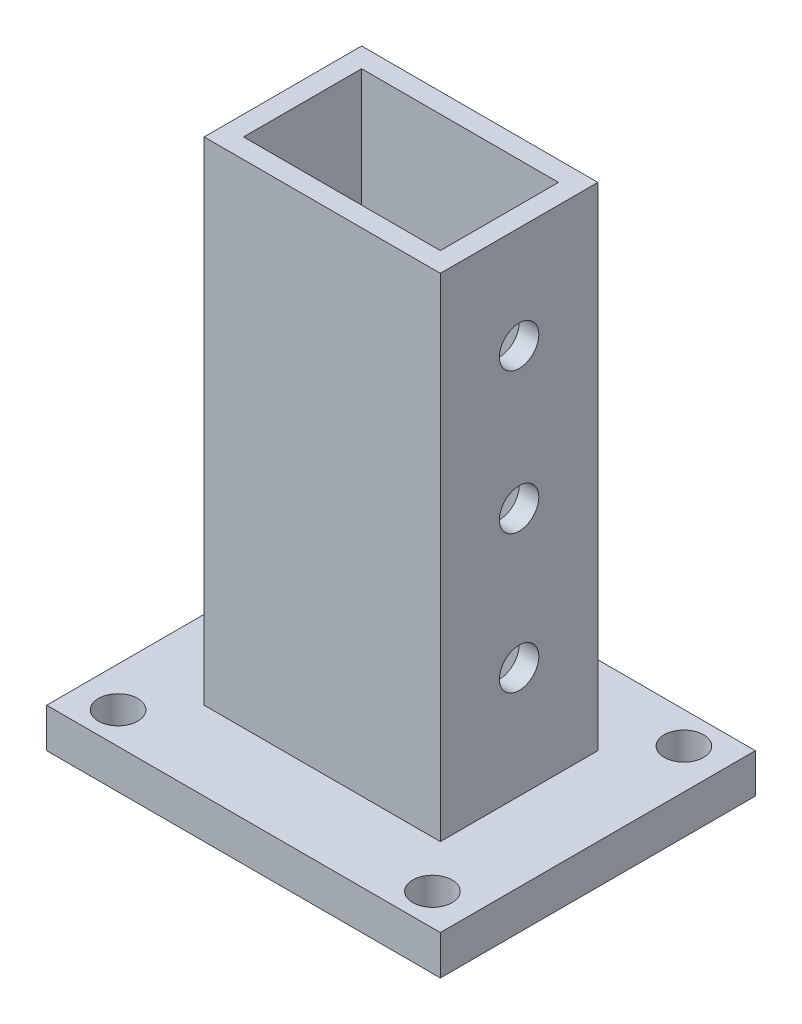
ISO-10303-21;
HEADER;
FILE_DESCRIPTION(('STEP AP214'),'2;1');
FILE_NAME('part.step','',(''),(''),'','','');
FILE_SCHEMA(('AUTOMOTIVE_DESIGN { 1 0 10303 214 1 1 1 1 }'));
ENDSEC;
DATA;
#1=APPLICATION_CONTEXT('core data for automotive mechanical design processes');
#2=APPLICATION_PROTOCOL_DEFINITION('international standard','automotive_design',2000,#1);
#3=PRODUCT_CONTEXT('',#1,'mechanical');
#4=PRODUCT('Part','Part','',(#3));
#5=PRODUCT_RELATED_PRODUCT_CATEGORY('part','',(#4));
#6=PRODUCT_DEFINITION_FORMATION('','',#4);
#7=PRODUCT_DEFINITION_CONTEXT('part definition',#1,'design');
#8=PRODUCT_DEFINITION('design','',#6,#7);
#9=PRODUCT_DEFINITION_SHAPE('','',#8);
#10=(LENGTH_UNIT() NAMED_UNIT(*) SI_UNIT(.MILLI.,.METRE.));
#11=(NAMED_UNIT(*) PLANE_ANGLE_UNIT() SI_UNIT($,.RADIAN.));
#12=(NAMED_UNIT(*) SI_UNIT($,.STERADIAN.) SOLID_ANGLE_UNIT());
#13=UNCERTAINTY_MEASURE_WITH_UNIT(LENGTH_MEASURE(1.E-05),#10,'distance_accuracy_value','');
#14=(GEOMETRIC_REPRESENTATION_CONTEXT(3) GLOBAL_UNCERTAINTY_ASSIGNED_CONTEXT((#13)) GLOBAL_UNIT_ASSIGNED_CONTEXT((#10,
#11,#12)) REPRESENTATION_CONTEXT('',''));
#15=CARTESIAN_POINT('',(0.,0.,0.));
#16=DIRECTION('',(0.,0.,1.));
#17=DIRECTION('',(1.,0.,0.));
#18=AXIS2_PLACEMENT_3D('',#15,#16,#17);
#19=CARTESIAN_POINT('',(0.,10.,0.));
#20=DIRECTION('',(0.,-1.,0.));
#21=DIRECTION('',(0.,0.,-1.));
#22=AXIS2_PLACEMENT_3D('',#19,#20,#21);
#23=PLANE('',#22);
#24=DIRECTION('',(0.,0.,1.));
#25=VECTOR('',#24,1.);
#26=CARTESIAN_POINT('',(-50.,10.,-40.));
#27=LINE('',#26,#25);
#28=CARTESIAN_POINT('',(-50.,10.,-40.));
#29=VERTEX_POINT('',#28);
#30=CARTESIAN_POINT('',(-50.,10.,40.));
#31=VERTEX_POINT('',#30);
#32=EDGE_CURVE('E243',#29,#31,#27,.T.);
#33=ORIENTED_EDGE('',*,*,#32,.T.);
#34=DIRECTION('',(1.,0.,0.));
#35=VECTOR('',#34,1.);
#36=CARTESIAN_POINT('',(50.,10.,40.));
#37=LINE('',#36,#35);
#38=CARTESIAN_POINT('',(50.,10.,40.));
#39=VERTEX_POINT('',#38);
#40=EDGE_CURVE('E246',#31,#39,#37,.T.);
#41=ORIENTED_EDGE('',*,*,#40,.T.);
#42=DIRECTION('',(0.,0.,-1.));
#43=VECTOR('',#42,1.);
#44=CARTESIAN_POINT('',(50.,10.,-40.));
#45=LINE('',#44,#43);
#46=CARTESIAN_POINT('',(50.,10.,-40.));
#47=VERTEX_POINT('',#46);
#48=EDGE_CURVE('E249',#39,#47,#45,.T.);
#49=ORIENTED_EDGE('',*,*,#48,.T.);
#50=DIRECTION('',(-1.,0.,0.));
#51=VECTOR('',#50,1.);
#52=CARTESIAN_POINT('',(50.,10.,-40.));
#53=LINE('',#52,#51);
#54=EDGE_CURVE('E251',#47,#29,#53,.T.);
#55=ORIENTED_EDGE('',*,*,#54,.T.);
#56=EDGE_LOOP('',(#33,#41,#49,#55));
#57=FACE_BOUND('',#56,.T.);
#58=CARTESIAN_POINT('',(-39.9187266223049,10.,-31.9349812978439));
#59=DIRECTION('',(0.,1.,0.));
#60=DIRECTION('',(0.,0.,1.));
#61=AXIS2_PLACEMENT_3D('',#58,#59,#60);
#62=CIRCLE('',#61,5.);
#63=CARTESIAN_POINT('',(-39.9187266223049,10.,-26.9349812978439));
#64=VERTEX_POINT('',#63);
#65=EDGE_CURVE('E237',#64,#64,#62,.T.);
#66=ORIENTED_EDGE('',*,*,#65,.F.);
#67=EDGE_LOOP('',(#66));
#68=FACE_BOUND('',#67,.T.);
#69=CARTESIAN_POINT('',(39.9187266223049,10.,-31.9349812978439));
#70=DIRECTION('',(0.,1.,0.));
#71=DIRECTION('',(0.,0.,1.));
#72=AXIS2_PLACEMENT_3D('',#69,#70,#71);
#73=CIRCLE('',#72,5.);
#74=CARTESIAN_POINT('',(39.9187266223049,10.,-26.9349812978439));
#75=VERTEX_POINT('',#74);
#76=EDGE_CURVE('E231',#75,#75,#73,.T.);
#77=ORIENTED_EDGE('',*,*,#76,.F.);
#78=EDGE_LOOP('',(#77));
#79=FACE_BOUND('',#78,.T.);
#80=CARTESIAN_POINT('',(39.9187266223049,10.,31.9349812978439));
#81=DIRECTION('',(0.,1.,0.));
#82=DIRECTION('',(0.,0.,1.));
#83=AXIS2_PLACEMENT_3D('',#80,#81,#82);
#84=CIRCLE('',#83,5.);
#85=CARTESIAN_POINT('',(39.9187266223049,10.,36.9349812978439));
#86=VERTEX_POINT('',#85);
#87=EDGE_CURVE('E225',#86,#86,#84,.T.);
#88=ORIENTED_EDGE('',*,*,#87,.F.);
#89=EDGE_LOOP('',(#88));
#90=FACE_BOUND('',#89,.T.);
#91=CARTESIAN_POINT('',(-39.918726622305,10.,31.934981297844));
#92=DIRECTION('',(0.,1.,0.));
#93=DIRECTION('',(0.,0.,1.));
#94=AXIS2_PLACEMENT_3D('',#91,#92,#93);
#95=CIRCLE('',#94,5.);
#96=CARTESIAN_POINT('',(-39.918726622305,10.,36.934981297844));
#97=VERTEX_POINT('',#96);
#98=EDGE_CURVE('E219',#97,#97,#95,.T.);
#99=ORIENTED_EDGE('',*,*,#98,.F.);
#100=EDGE_LOOP('',(#99));
#101=FACE_BOUND('',#100,.T.);
#102=DIRECTION('',(0.,0.,-1.));
#103=VECTOR('',#102,1.);
#104=CARTESIAN_POINT('',(30.,10.,0.));
#105=LINE('',#104,#103);
#106=CARTESIAN_POINT('',(30.,10.,20.));
#107=VERTEX_POINT('',#106);
#108=CARTESIAN_POINT('',(30.,10.,-20.));
#109=VERTEX_POINT('',#108);
#110=EDGE_CURVE('E165',#107,#109,#105,.T.);
#111=ORIENTED_EDGE('',*,*,#110,.F.);
#112=DIRECTION('',(1.,0.,0.));
#113=VECTOR('',#112,1.);
#114=CARTESIAN_POINT('',(0.,10.,20.));
#115=LINE('',#114,#113);
#116=CARTESIAN_POINT('',(-30.,10.,20.));
#117=VERTEX_POINT('',#116);
#118=EDGE_CURVE('E195',#117,#107,#115,.T.);
#119=ORIENTED_EDGE('',*,*,#118,.F.);
#120=DIRECTION('',(0.,0.,1.));
#121=VECTOR('',#120,1.);
#122=CARTESIAN_POINT('',(-30.,10.,0.));
#123=LINE('',#122,#121);
#124=CARTESIAN_POINT('',(-30.,10.,-20.));
#125=VERTEX_POINT('',#124);
#126=EDGE_CURVE('E79',#125,#117,#123,.T.);
#127=ORIENTED_EDGE('',*,*,#126,.F.);
#128=DIRECTION('',(-1.,0.,0.));
#129=VECTOR('',#128,1.);
#130=CARTESIAN_POINT('',(0.,10.,-20.));
#131=LINE('',#130,#129);
#132=EDGE_CURVE('E74',#109,#125,#131,.T.);
#133=ORIENTED_EDGE('',*,*,#132,.F.);
#134=EDGE_LOOP('',(#111,#119,#127,#133));
#135=FACE_BOUND('',#134,.T.);
#136=ADVANCED_FACE('F57',(#57,#68,#79,#90,#101,#135),#23,.F.);
#137=CARTESIAN_POINT('',(0.,0.,0.));
#138=DIRECTION('',(0.,-1.,0.));
#139=DIRECTION('',(0.,0.,-1.));
#140=AXIS2_PLACEMENT_3D('',#137,#138,#139);
#141=PLANE('',#140);
#142=CARTESIAN_POINT('',(39.9187266223049,0.,31.9349812978439));
#143=DIRECTION('',(0.,1.,0.));
#144=DIRECTION('',(0.,0.,1.));
#145=AXIS2_PLACEMENT_3D('',#142,#143,#144);
#146=CIRCLE('',#145,5.);
#147=CARTESIAN_POINT('',(39.9187266223049,0.,36.9349812978439));
#148=VERTEX_POINT('',#147);
#149=EDGE_CURVE('E222',#148,#148,#146,.T.);
#150=ORIENTED_EDGE('',*,*,#149,.T.);
#151=EDGE_LOOP('',(#150));
#152=FACE_BOUND('',#151,.T.);
#153=CARTESIAN_POINT('',(-39.9187266223049,0.,-31.9349812978439));
#154=DIRECTION('',(0.,1.,0.));
#155=DIRECTION('',(0.,0.,1.));
#156=AXIS2_PLACEMENT_3D('',#153,#154,#155);
#157=CIRCLE('',#156,5.);
#158=CARTESIAN_POINT('',(-39.9187266223049,0.,-26.9349812978439));
#159=VERTEX_POINT('',#158);
#160=EDGE_CURVE('E234',#159,#159,#157,.T.);
#161=ORIENTED_EDGE('',*,*,#160,.T.);
#162=EDGE_LOOP('',(#161));
#163=FACE_BOUND('',#162,.T.);
#164=DIRECTION('',(0.,0.,1.));
#165=VECTOR('',#164,1.);
#166=CARTESIAN_POINT('',(-50.,0.,-40.));
#167=LINE('',#166,#165);
#168=CARTESIAN_POINT('',(-50.,0.,-40.));
#169=VERTEX_POINT('',#168);
#170=CARTESIAN_POINT('',(-50.,0.,40.));
#171=VERTEX_POINT('',#170);
#172=EDGE_CURVE('E240',#169,#171,#167,.T.);
#173=ORIENTED_EDGE('',*,*,#172,.F.);
#174=DIRECTION('',(-1.,0.,0.));
#175=VECTOR('',#174,1.);
#176=CARTESIAN_POINT('',(50.,0.,-40.));
#177=LINE('',#176,#175);
#178=CARTESIAN_POINT('',(50.,0.,-40.));
#179=VERTEX_POINT('',#178);
#180=EDGE_CURVE('E247',#179,#169,#177,.T.);
#181=ORIENTED_EDGE('',*,*,#180,.F.);
#182=DIRECTION('',(0.,0.,-1.));
#183=VECTOR('',#182,1.);
#184=CARTESIAN_POINT('',(50.,0.,-40.));
#185=LINE('',#184,#183);
#186=CARTESIAN_POINT('',(50.,0.,40.));
#187=VERTEX_POINT('',#186);
#188=EDGE_CURVE('E258',#187,#179,#185,.T.);
#189=ORIENTED_EDGE('',*,*,#188,.F.);
#190=DIRECTION('',(1.,0.,0.));
#191=VECTOR('',#190,1.);
#192=CARTESIAN_POINT('',(50.,0.,40.));
#193=LINE('',#192,#191);
#194=EDGE_CURVE('E256',#171,#187,#193,.T.);
#195=ORIENTED_EDGE('',*,*,#194,.F.);
#196=EDGE_LOOP('',(#173,#181,#189,#195));
#197=FACE_BOUND('',#196,.T.);
#198=CARTESIAN_POINT('',(39.9187266223049,0.,-31.9349812978439));
#199=DIRECTION('',(0.,1.,0.));
#200=DIRECTION('',(0.,0.,1.));
#201=AXIS2_PLACEMENT_3D('',#198,#199,#200);
#202=CIRCLE('',#201,5.);
#203=CARTESIAN_POINT('',(39.9187266223049,0.,-26.9349812978439));
#204=VERTEX_POINT('',#203);
#205=EDGE_CURVE('E228',#204,#204,#202,.T.);
#206=ORIENTED_EDGE('',*,*,#205,.T.);
#207=EDGE_LOOP('',(#206));
#208=FACE_BOUND('',#207,.T.);
#209=CARTESIAN_POINT('',(-39.918726622305,0.,31.934981297844));
#210=DIRECTION('',(0.,1.,0.));
#211=DIRECTION('',(0.,0.,1.));
#212=AXIS2_PLACEMENT_3D('',#209,#210,#211);
#213=CIRCLE('',#212,5.);
#214=CARTESIAN_POINT('',(-39.918726622305,0.,36.934981297844));
#215=VERTEX_POINT('',#214);
#216=EDGE_CURVE('E218',#215,#215,#213,.T.);
#217=ORIENTED_EDGE('',*,*,#216,.T.);
#218=EDGE_LOOP('',(#217));
#219=FACE_BOUND('',#218,.T.);
#220=ADVANCED_FACE('F315',(#152,#163,#197,#208,#219),#141,.T.);
#221=CARTESIAN_POINT('',(-50.,10.,-40.));
#222=DIRECTION('',(1.,0.,0.));
#223=DIRECTION('',(0.,0.,-1.));
#224=AXIS2_PLACEMENT_3D('',#221,#222,#223);
#225=PLANE('',#224);
#226=ORIENTED_EDGE('',*,*,#172,.T.);
#227=DIRECTION('',(0.,-1.,0.));
#228=VECTOR('',#227,1.);
#229=CARTESIAN_POINT('',(-50.,10.,40.));
#230=LINE('',#229,#228);
#231=EDGE_CURVE('E12',#31,#171,#230,.T.);
#232=ORIENTED_EDGE('',*,*,#231,.F.);
#233=ORIENTED_EDGE('',*,*,#32,.F.);
#234=DIRECTION('',(0.,-1.,0.));
#235=VECTOR('',#234,1.);
#236=CARTESIAN_POINT('',(-50.,10.,-40.));
#237=LINE('',#236,#235);
#238=EDGE_CURVE('E253',#29,#169,#237,.T.);
#239=ORIENTED_EDGE('',*,*,#238,.T.);
#240=EDGE_LOOP('',(#226,#232,#233,#239));
#241=FACE_BOUND('',#240,.T.);
#242=ADVANCED_FACE('F59',(#241),#225,.F.);
#243=CARTESIAN_POINT('',(50.,10.,40.));
#244=DIRECTION('',(0.,0.,-1.));
#245=DIRECTION('',(-1.,0.,0.));
#246=AXIS2_PLACEMENT_3D('',#243,#244,#245);
#247=PLANE('',#246);
#248=ORIENTED_EDGE('',*,*,#194,.T.);
#249=DIRECTION('',(0.,-1.,0.));
#250=VECTOR('',#249,1.);
#251=CARTESIAN_POINT('',(50.,10.,40.));
#252=LINE('',#251,#250);
#253=EDGE_CURVE('E66',#39,#187,#252,.T.);
#254=ORIENTED_EDGE('',*,*,#253,.F.);
#255=ORIENTED_EDGE('',*,*,#40,.F.);
#256=ORIENTED_EDGE('',*,*,#231,.T.);
#257=EDGE_LOOP('',(#248,#254,#255,#256));
#258=FACE_BOUND('',#257,.T.);
#259=ADVANCED_FACE('F417',(#258),#247,.F.);
#260=CARTESIAN_POINT('',(50.,10.,-40.));
#261=DIRECTION('',(-1.,0.,0.));
#262=DIRECTION('',(0.,0.,1.));
#263=AXIS2_PLACEMENT_3D('',#260,#261,#262);
#264=PLANE('',#263);
#265=ORIENTED_EDGE('',*,*,#188,.T.);
#266=DIRECTION('',(0.,-1.,0.));
#267=VECTOR('',#266,1.);
#268=CARTESIAN_POINT('',(50.,10.,-40.));
#269=LINE('',#268,#267);
#270=EDGE_CURVE('E263',#47,#179,#269,.T.);
#271=ORIENTED_EDGE('',*,*,#270,.F.);
#272=ORIENTED_EDGE('',*,*,#48,.F.);
#273=ORIENTED_EDGE('',*,*,#253,.T.);
#274=EDGE_LOOP('',(#265,#271,#272,#273));
#275=FACE_BOUND('',#274,.T.);
#276=ADVANCED_FACE('F390',(#275),#264,.F.);
#277=CARTESIAN_POINT('',(50.,10.,-40.));
#278=DIRECTION('',(0.,0.,1.));
#279=DIRECTION('',(1.,0.,0.));
#280=AXIS2_PLACEMENT_3D('',#277,#278,#279);
#281=PLANE('',#280);
#282=ORIENTED_EDGE('',*,*,#180,.T.);
#283=ORIENTED_EDGE('',*,*,#238,.F.);
#284=ORIENTED_EDGE('',*,*,#54,.F.);
#285=ORIENTED_EDGE('',*,*,#270,.T.);
#286=EDGE_LOOP('',(#282,#283,#284,#285));
#287=FACE_BOUND('',#286,.T.);
#288=ADVANCED_FACE('F385',(#287),#281,.F.);
#289=CARTESIAN_POINT('',(-39.9187266223049,10.,-31.9349812978439));
#290=DIRECTION('',(0.,-1.,0.));
#291=DIRECTION('',(0.,0.,-1.));
#292=AXIS2_PLACEMENT_3D('',#289,#290,#291);
#293=CYLINDRICAL_SURFACE('',#292,5.);
#294=ORIENTED_EDGE('',*,*,#65,.T.);
#295=EDGE_LOOP('',(#294));
#296=FACE_BOUND('',#295,.T.);
#297=ORIENTED_EDGE('',*,*,#160,.F.);
#298=EDGE_LOOP('',(#297));
#299=FACE_BOUND('',#298,.T.);
#300=ADVANCED_FACE('F382',(#296,#299),#293,.F.);
#301=CARTESIAN_POINT('',(39.9187266223049,10.,-31.9349812978439));
#302=DIRECTION('',(0.,-1.,0.));
#303=DIRECTION('',(0.,0.,-1.));
#304=AXIS2_PLACEMENT_3D('',#301,#302,#303);
#305=CYLINDRICAL_SURFACE('',#304,5.);
#306=ORIENTED_EDGE('',*,*,#76,.T.);
#307=EDGE_LOOP('',(#306));
#308=FACE_BOUND('',#307,.T.);
#309=ORIENTED_EDGE('',*,*,#205,.F.);
#310=EDGE_LOOP('',(#309));
#311=FACE_BOUND('',#310,.T.);
#312=ADVANCED_FACE('F379',(#308,#311),#305,.F.);
#313=CARTESIAN_POINT('',(39.9187266223049,10.,31.9349812978439));
#314=DIRECTION('',(0.,-1.,0.));
#315=DIRECTION('',(0.,0.,-1.));
#316=AXIS2_PLACEMENT_3D('',#313,#314,#315);
#317=CYLINDRICAL_SURFACE('',#316,5.);
#318=ORIENTED_EDGE('',*,*,#87,.T.);
#319=EDGE_LOOP('',(#318));
#320=FACE_BOUND('',#319,.T.);
#321=ORIENTED_EDGE('',*,*,#149,.F.);
#322=EDGE_LOOP('',(#321));
#323=FACE_BOUND('',#322,.T.);
#324=ADVANCED_FACE('F375',(#320,#323),#317,.F.);
#325=CARTESIAN_POINT('',(-39.918726622305,10.,31.934981297844));
#326=DIRECTION('',(0.,-1.,0.));
#327=DIRECTION('',(0.,0.,-1.));
#328=AXIS2_PLACEMENT_3D('',#325,#326,#327);
#329=CYLINDRICAL_SURFACE('',#328,5.);
#330=ORIENTED_EDGE('',*,*,#98,.T.);
#331=EDGE_LOOP('',(#330));
#332=FACE_BOUND('',#331,.T.);
#333=ORIENTED_EDGE('',*,*,#216,.F.);
#334=EDGE_LOOP('',(#333));
#335=FACE_BOUND('',#334,.T.);
#336=ADVANCED_FACE('F358',(#332,#335),#329,.F.);
#337=CARTESIAN_POINT('',(0.,135.,0.));
#338=DIRECTION('',(0.,1.,0.));
#339=DIRECTION('',(0.,0.,1.));
#340=AXIS2_PLACEMENT_3D('',#337,#338,#339);
#341=PLANE('',#340);
#342=DIRECTION('',(0.,0.,-1.));
#343=VECTOR('',#342,1.);
#344=CARTESIAN_POINT('',(30.,135.,0.));
#345=LINE('',#344,#343);
#346=CARTESIAN_POINT('',(30.,135.,20.));
#347=VERTEX_POINT('',#346);
#348=CARTESIAN_POINT('',(30.,135.,-20.));
#349=VERTEX_POINT('',#348);
#350=EDGE_CURVE('E191',#347,#349,#345,.T.);
#351=ORIENTED_EDGE('',*,*,#350,.T.);
#352=DIRECTION('',(-1.,0.,0.));
#353=VECTOR('',#352,1.);
#354=CARTESIAN_POINT('',(0.,135.,-20.));
#355=LINE('',#354,#353);
#356=CARTESIAN_POINT('',(-30.,135.,-20.));
#357=VERTEX_POINT('',#356);
#358=EDGE_CURVE('E194',#349,#357,#355,.T.);
#359=ORIENTED_EDGE('',*,*,#358,.T.);
#360=DIRECTION('',(0.,0.,1.));
#361=VECTOR('',#360,1.);
#362=CARTESIAN_POINT('',(-30.,135.,0.));
#363=LINE('',#362,#361);
#364=CARTESIAN_POINT('',(-30.,135.,20.));
#365=VERTEX_POINT('',#364);
#366=EDGE_CURVE('E197',#357,#365,#363,.T.);
#367=ORIENTED_EDGE('',*,*,#366,.T.);
#368=DIRECTION('',(1.,0.,0.));
#369=VECTOR('',#368,1.);
#370=CARTESIAN_POINT('',(0.,135.,20.));
#371=LINE('',#370,#369);
#372=EDGE_CURVE('E199',#365,#347,#371,.T.);
#373=ORIENTED_EDGE('',*,*,#372,.T.);
#374=EDGE_LOOP('',(#351,#359,#367,#373));
#375=FACE_BOUND('',#374,.T.);
#376=DIRECTION('',(-1.,0.,0.));
#377=VECTOR('',#376,1.);
#378=CARTESIAN_POINT('',(-25.,135.,-15.));
#379=LINE('',#378,#377);
#380=CARTESIAN_POINT('',(25.,135.,-15.));
#381=VERTEX_POINT('',#380);
#382=CARTESIAN_POINT('',(-25.,135.,-15.));
#383=VERTEX_POINT('',#382);
#384=EDGE_CURVE('E157',#381,#383,#379,.T.);
#385=ORIENTED_EDGE('',*,*,#384,.F.);
#386=DIRECTION('',(0.,0.,-1.));
#387=VECTOR('',#386,1.);
#388=CARTESIAN_POINT('',(25.,135.,15.));
#389=LINE('',#388,#387);
#390=CARTESIAN_POINT('',(25.,135.,15.));
#391=VERTEX_POINT('',#390);
#392=EDGE_CURVE('E147',#391,#381,#389,.T.);
#393=ORIENTED_EDGE('',*,*,#392,.F.);
#394=DIRECTION('',(1.,0.,0.));
#395=VECTOR('',#394,1.);
#396=CARTESIAN_POINT('',(-25.,135.,15.));
#397=LINE('',#396,#395);
#398=CARTESIAN_POINT('',(-25.,135.,15.));
#399=VERTEX_POINT('',#398);
#400=EDGE_CURVE('E173',#399,#391,#397,.T.);
#401=ORIENTED_EDGE('',*,*,#400,.F.);
#402=DIRECTION('',(0.,0.,1.));
#403=VECTOR('',#402,1.);
#404=CARTESIAN_POINT('',(-25.,135.,15.));
#405=LINE('',#404,#403);
#406=EDGE_CURVE('E171',#383,#399,#405,.T.);
#407=ORIENTED_EDGE('',*,*,#406,.F.);
#408=EDGE_LOOP('',(#385,#393,#401,#407));
#409=FACE_BOUND('',#408,.T.);
#410=ADVANCED_FACE('F169',(#375,#409),#341,.T.);
#411=CARTESIAN_POINT('',(30.,135.,0.));
#412=DIRECTION('',(-1.,0.,0.));
#413=DIRECTION('',(0.,0.,1.));
#414=AXIS2_PLACEMENT_3D('',#411,#412,#413);
#415=PLANE('',#414);
#416=CARTESIAN_POINT('',(30.,38.2290885239722,0.));
#417=DIRECTION('',(-1.,0.,0.));
#418=DIRECTION('',(0.,0.,1.));
#419=AXIS2_PLACEMENT_3D('',#416,#417,#418);
#420=CIRCLE('',#419,5.);
#421=CARTESIAN_POINT('',(30.,38.2290885239722,5.));
#422=VERTEX_POINT('',#421);
#423=EDGE_CURVE('E180',#422,#422,#420,.T.);
#424=ORIENTED_EDGE('',*,*,#423,.T.);
#425=EDGE_LOOP('',(#424));
#426=FACE_BOUND('',#425,.T.);
#427=CARTESIAN_POINT('',(30.,73.2807756206577,0.));
#428=DIRECTION('',(-1.,0.,0.));
#429=DIRECTION('',(0.,0.,1.));
#430=AXIS2_PLACEMENT_3D('',#427,#428,#429);
#431=CIRCLE('',#430,5.);
#432=CARTESIAN_POINT('',(30.,73.2807756206577,5.));
#433=VERTEX_POINT('',#432);
#434=EDGE_CURVE('E279',#433,#433,#431,.T.);
#435=ORIENTED_EDGE('',*,*,#434,.T.);
#436=EDGE_LOOP('',(#435));
#437=FACE_BOUND('',#436,.T.);
#438=CARTESIAN_POINT('',(30.,109.066529462824,0.));
#439=DIRECTION('',(-1.,0.,0.));
#440=DIRECTION('',(0.,0.,1.));
#441=AXIS2_PLACEMENT_3D('',#438,#439,#440);
#442=CIRCLE('',#441,5.);
#443=CARTESIAN_POINT('',(30.,109.066529462824,5.));
#444=VERTEX_POINT('',#443);
#445=EDGE_CURVE('E275',#444,#444,#442,.T.);
#446=ORIENTED_EDGE('',*,*,#445,.T.);
#447=EDGE_LOOP('',(#446));
#448=FACE_BOUND('',#447,.T.);
#449=ORIENTED_EDGE('',*,*,#110,.T.);
#450=DIRECTION('',(0.,-1.,0.));
#451=VECTOR('',#450,1.);
#452=CARTESIAN_POINT('',(30.,135.,-20.));
#453=LINE('',#452,#451);
#454=EDGE_CURVE('E216',#349,#109,#453,.T.);
#455=ORIENTED_EDGE('',*,*,#454,.F.);
#456=ORIENTED_EDGE('',*,*,#350,.F.);
#457=DIRECTION('',(0.,-1.,0.));
#458=VECTOR('',#457,1.);
#459=CARTESIAN_POINT('',(30.,135.,20.));
#460=LINE('',#459,#458);
#461=EDGE_CURVE('E201',#347,#107,#460,.T.);
#462=ORIENTED_EDGE('',*,*,#461,.T.);
#463=EDGE_LOOP('',(#449,#455,#456,#462));
#464=FACE_BOUND('',#463,.T.);
#465=ADVANCED_FACE('F296',(#426,#437,#448,#464),#415,.F.);
#466=CARTESIAN_POINT('',(0.,135.,-20.));
#467=DIRECTION('',(0.,0.,1.));
#468=DIRECTION('',(1.,0.,0.));
#469=AXIS2_PLACEMENT_3D('',#466,#467,#468);
#470=PLANE('',#469);
#471=ORIENTED_EDGE('',*,*,#132,.T.);
#472=DIRECTION('',(0.,-1.,0.));
#473=VECTOR('',#472,1.);
#474=CARTESIAN_POINT('',(-30.,135.,-20.));
#475=LINE('',#474,#473);
#476=EDGE_CURVE('E213',#357,#125,#475,.T.);
#477=ORIENTED_EDGE('',*,*,#476,.F.);
#478=ORIENTED_EDGE('',*,*,#358,.F.);
#479=ORIENTED_EDGE('',*,*,#454,.T.);
#480=EDGE_LOOP('',(#471,#477,#478,#479));
#481=FACE_BOUND('',#480,.T.);
#482=ADVANCED_FACE('F366',(#481),#470,.F.);
#483=CARTESIAN_POINT('',(-30.,135.,0.));
#484=DIRECTION('',(1.,0.,0.));
#485=DIRECTION('',(0.,0.,-1.));
#486=AXIS2_PLACEMENT_3D('',#483,#484,#485);
#487=PLANE('',#486);
#488=CARTESIAN_POINT('',(-30.,38.2290885239722,0.));
#489=DIRECTION('',(-1.,0.,0.));
#490=DIRECTION('',(0.,0.,1.));
#491=AXIS2_PLACEMENT_3D('',#488,#489,#490);
#492=CIRCLE('',#491,5.);
#493=CARTESIAN_POINT('',(-30.,38.2290885239722,5.));
#494=VERTEX_POINT('',#493);
#495=EDGE_CURVE('E271',#494,#494,#492,.T.);
#496=ORIENTED_EDGE('',*,*,#495,.F.);
#497=EDGE_LOOP('',(#496));
#498=FACE_BOUND('',#497,.T.);
#499=CARTESIAN_POINT('',(-30.,73.2807756206577,0.));
#500=DIRECTION('',(-1.,0.,0.));
#501=DIRECTION('',(0.,0.,1.));
#502=AXIS2_PLACEMENT_3D('',#499,#500,#501);
#503=CIRCLE('',#502,5.);
#504=CARTESIAN_POINT('',(-30.,73.2807756206577,5.));
#505=VERTEX_POINT('',#504);
#506=EDGE_CURVE('E563',#505,#505,#503,.T.);
#507=ORIENTED_EDGE('',*,*,#506,.F.);
#508=EDGE_LOOP('',(#507));
#509=FACE_BOUND('',#508,.T.);
#510=CARTESIAN_POINT('',(-30.,109.066529462824,0.));
#511=DIRECTION('',(-1.,0.,0.));
#512=DIRECTION('',(0.,0.,1.));
#513=AXIS2_PLACEMENT_3D('',#510,#511,#512);
#514=CIRCLE('',#513,5.);
#515=CARTESIAN_POINT('',(-30.,109.066529462824,5.));
#516=VERTEX_POINT('',#515);
#517=EDGE_CURVE('E565',#516,#516,#514,.T.);
#518=ORIENTED_EDGE('',*,*,#517,.F.);
#519=EDGE_LOOP('',(#518));
#520=FACE_BOUND('',#519,.T.);
#521=ORIENTED_EDGE('',*,*,#126,.T.);
#522=DIRECTION('',(0.,-1.,0.));
#523=VECTOR('',#522,1.);
#524=CARTESIAN_POINT('',(-30.,135.,20.));
#525=LINE('',#524,#523);
#526=EDGE_CURVE('E210',#365,#117,#525,.T.);
#527=ORIENTED_EDGE('',*,*,#526,.F.);
#528=ORIENTED_EDGE('',*,*,#366,.F.);
#529=ORIENTED_EDGE('',*,*,#476,.T.);
#530=EDGE_LOOP('',(#521,#527,#528,#529));
#531=FACE_BOUND('',#530,.T.);
#532=ADVANCED_FACE('F362',(#498,#509,#520,#531),#487,.F.);
#533=CARTESIAN_POINT('',(0.,135.,20.));
#534=DIRECTION('',(0.,0.,-1.));
#535=DIRECTION('',(-1.,0.,0.));
#536=AXIS2_PLACEMENT_3D('',#533,#534,#535);
#537=PLANE('',#536);
#538=ORIENTED_EDGE('',*,*,#118,.T.);
#539=ORIENTED_EDGE('',*,*,#461,.F.);
#540=ORIENTED_EDGE('',*,*,#372,.F.);
#541=ORIENTED_EDGE('',*,*,#526,.T.);
#542=EDGE_LOOP('',(#538,#539,#540,#541));
#543=FACE_BOUND('',#542,.T.);
#544=ADVANCED_FACE('F354',(#543),#537,.F.);
#545=CARTESIAN_POINT('',(25.,135.,15.));
#546=DIRECTION('',(-1.,0.,0.));
#547=DIRECTION('',(0.,0.,1.));
#548=AXIS2_PLACEMENT_3D('',#545,#546,#547);
#549=PLANE('',#548);
#550=CARTESIAN_POINT('',(25.,38.2290885239722,0.));
#551=DIRECTION('',(-1.,0.,0.));
#552=DIRECTION('',(0.,0.,1.));
#553=AXIS2_PLACEMENT_3D('',#550,#551,#552);
#554=CIRCLE('',#553,5.);
#555=CARTESIAN_POINT('',(25.,38.2290885239722,5.));
#556=VERTEX_POINT('',#555);
#557=EDGE_CURVE('E291',#556,#556,#554,.T.);
#558=ORIENTED_EDGE('',*,*,#557,.F.);
#559=EDGE_LOOP('',(#558));
#560=FACE_BOUND('',#559,.T.);
#561=CARTESIAN_POINT('',(25.,73.2807756206577,0.));
#562=DIRECTION('',(-1.,0.,0.));
#563=DIRECTION('',(0.,0.,1.));
#564=AXIS2_PLACEMENT_3D('',#561,#562,#563);
#565=CIRCLE('',#564,5.);
#566=CARTESIAN_POINT('',(25.,73.2807756206577,5.));
#567=VERTEX_POINT('',#566);
#568=EDGE_CURVE('E274',#567,#567,#565,.T.);
#569=ORIENTED_EDGE('',*,*,#568,.F.);
#570=EDGE_LOOP('',(#569));
#571=FACE_BOUND('',#570,.T.);
#572=CARTESIAN_POINT('',(25.,109.066529462824,0.));
#573=DIRECTION('',(-1.,0.,0.));
#574=DIRECTION('',(0.,0.,1.));
#575=AXIS2_PLACEMENT_3D('',#572,#573,#574);
#576=CIRCLE('',#575,5.);
#577=CARTESIAN_POINT('',(25.,109.066529462824,5.));
#578=VERTEX_POINT('',#577);
#579=EDGE_CURVE('E270',#578,#578,#576,.T.);
#580=ORIENTED_EDGE('',*,*,#579,.F.);
#581=EDGE_LOOP('',(#580));
#582=FACE_BOUND('',#581,.T.);
#583=DIRECTION('',(0.,0.,-1.));
#584=VECTOR('',#583,1.);
#585=CARTESIAN_POINT('',(25.,10.,15.));
#586=LINE('',#585,#584);
#587=CARTESIAN_POINT('',(25.,10.,15.));
#588=VERTEX_POINT('',#587);
#589=CARTESIAN_POINT('',(25.,10.,-15.));
#590=VERTEX_POINT('',#589);
#591=EDGE_CURVE('E178',#588,#590,#586,.T.);
#592=ORIENTED_EDGE('',*,*,#591,.F.);
#593=DIRECTION('',(0.,-1.,0.));
#594=VECTOR('',#593,1.);
#595=CARTESIAN_POINT('',(25.,135.,15.));
#596=LINE('',#595,#594);
#597=EDGE_CURVE('E153',#391,#588,#596,.T.);
#598=ORIENTED_EDGE('',*,*,#597,.F.);
#599=ORIENTED_EDGE('',*,*,#392,.T.);
#600=DIRECTION('',(0.,-1.,0.));
#601=VECTOR('',#600,1.);
#602=CARTESIAN_POINT('',(25.,135.,-15.));
#603=LINE('',#602,#601);
#604=EDGE_CURVE('E151',#381,#590,#603,.T.);
#605=ORIENTED_EDGE('',*,*,#604,.T.);
#606=EDGE_LOOP('',(#592,#598,#599,#605));
#607=FACE_BOUND('',#606,.T.);
#608=ADVANCED_FACE('F150',(#560,#571,#582,#607),#549,.T.);
#609=CARTESIAN_POINT('',(-25.,135.,-15.));
#610=DIRECTION('',(0.,0.,1.));
#611=DIRECTION('',(1.,0.,0.));
#612=AXIS2_PLACEMENT_3D('',#609,#610,#611);
#613=PLANE('',#612);
#614=DIRECTION('',(-1.,0.,0.));
#615=VECTOR('',#614,1.);
#616=CARTESIAN_POINT('',(-25.,10.,-15.));
#617=LINE('',#616,#615);
#618=CARTESIAN_POINT('',(-25.,10.,-15.));
#619=VERTEX_POINT('',#618);
#620=EDGE_CURVE('E164',#590,#619,#617,.T.);
#621=ORIENTED_EDGE('',*,*,#620,.F.);
#622=ORIENTED_EDGE('',*,*,#604,.F.);
#623=ORIENTED_EDGE('',*,*,#384,.T.);
#624=DIRECTION('',(0.,-1.,0.));
#625=VECTOR('',#624,1.);
#626=CARTESIAN_POINT('',(-25.,135.,-15.));
#627=LINE('',#626,#625);
#628=EDGE_CURVE('E166',#383,#619,#627,.T.);
#629=ORIENTED_EDGE('',*,*,#628,.T.);
#630=EDGE_LOOP('',(#621,#622,#623,#629));
#631=FACE_BOUND('',#630,.T.);
#632=ADVANCED_FACE('F161',(#631),#613,.T.);
#633=CARTESIAN_POINT('',(-25.,135.,15.));
#634=DIRECTION('',(1.,0.,0.));
#635=DIRECTION('',(0.,0.,-1.));
#636=AXIS2_PLACEMENT_3D('',#633,#634,#635);
#637=PLANE('',#636);
#638=CARTESIAN_POINT('',(-25.,38.2290885239722,0.));
#639=DIRECTION('',(1.,0.,0.));
#640=DIRECTION('',(0.,0.,-1.));
#641=AXIS2_PLACEMENT_3D('',#638,#639,#640);
#642=CIRCLE('',#641,5.);
#643=CARTESIAN_POINT('',(-25.,38.2290885239722,-5.));
#644=VERTEX_POINT('',#643);
#645=EDGE_CURVE('E61',#644,#644,#642,.T.);
#646=ORIENTED_EDGE('',*,*,#645,.F.);
#647=EDGE_LOOP('',(#646));
#648=FACE_BOUND('',#647,.T.);
#649=CARTESIAN_POINT('',(-25.,73.2807756206577,0.));
#650=DIRECTION('',(1.,0.,0.));
#651=DIRECTION('',(0.,0.,-1.));
#652=AXIS2_PLACEMENT_3D('',#649,#650,#651);
#653=CIRCLE('',#652,5.);
#654=CARTESIAN_POINT('',(-25.,73.2807756206577,-5.));
#655=VERTEX_POINT('',#654);
#656=EDGE_CURVE('E272',#655,#655,#653,.T.);
#657=ORIENTED_EDGE('',*,*,#656,.F.);
#658=EDGE_LOOP('',(#657));
#659=FACE_BOUND('',#658,.T.);
#660=CARTESIAN_POINT('',(-25.,109.066529462824,0.));
#661=DIRECTION('',(1.,0.,0.));
#662=DIRECTION('',(0.,0.,-1.));
#663=AXIS2_PLACEMENT_3D('',#660,#661,#662);
#664=CIRCLE('',#663,5.);
#665=CARTESIAN_POINT('',(-25.,109.066529462824,-5.));
#666=VERTEX_POINT('',#665);
#667=EDGE_CURVE('E268',#666,#666,#664,.T.);
#668=ORIENTED_EDGE('',*,*,#667,.F.);
#669=EDGE_LOOP('',(#668));
#670=FACE_BOUND('',#669,.T.);
#671=DIRECTION('',(0.,0.,1.));
#672=VECTOR('',#671,1.);
#673=CARTESIAN_POINT('',(-25.,10.,15.));
#674=LINE('',#673,#672);
#675=CARTESIAN_POINT('',(-25.,10.,15.));
#676=VERTEX_POINT('',#675);
#677=EDGE_CURVE('E182',#619,#676,#674,.T.);
#678=ORIENTED_EDGE('',*,*,#677,.F.);
#679=ORIENTED_EDGE('',*,*,#628,.F.);
#680=ORIENTED_EDGE('',*,*,#406,.T.);
#681=DIRECTION('',(0.,-1.,0.));
#682=VECTOR('',#681,1.);
#683=CARTESIAN_POINT('',(-25.,135.,15.));
#684=LINE('',#683,#682);
#685=EDGE_CURVE('E188',#399,#676,#684,.T.);
#686=ORIENTED_EDGE('',*,*,#685,.T.);
#687=EDGE_LOOP('',(#678,#679,#680,#686));
#688=FACE_BOUND('',#687,.T.);
#689=ADVANCED_FACE('F336',(#648,#659,#670,#688),#637,.T.);
#690=CARTESIAN_POINT('',(-25.,135.,15.));
#691=DIRECTION('',(0.,0.,-1.));
#692=DIRECTION('',(-1.,0.,0.));
#693=AXIS2_PLACEMENT_3D('',#690,#691,#692);
#694=PLANE('',#693);
#695=DIRECTION('',(1.,0.,0.));
#696=VECTOR('',#695,1.);
#697=CARTESIAN_POINT('',(-25.,10.,15.));
#698=LINE('',#697,#696);
#699=EDGE_CURVE('E158',#676,#588,#698,.T.);
#700=ORIENTED_EDGE('',*,*,#699,.F.);
#701=ORIENTED_EDGE('',*,*,#685,.F.);
#702=ORIENTED_EDGE('',*,*,#400,.T.);
#703=ORIENTED_EDGE('',*,*,#597,.T.);
#704=EDGE_LOOP('',(#700,#701,#702,#703));
#705=FACE_BOUND('',#704,.T.);
#706=ADVANCED_FACE('F328',(#705),#694,.T.);
#707=ORIENTED_EDGE('',*,*,#699,.T.);
#708=ORIENTED_EDGE('',*,*,#591,.T.);
#709=ORIENTED_EDGE('',*,*,#620,.T.);
#710=ORIENTED_EDGE('',*,*,#677,.T.);
#711=EDGE_LOOP('',(#707,#708,#709,#710));
#712=FACE_BOUND('',#711,.T.);
#713=ADVANCED_FACE('F318',(#712),#23,.F.);
#714=CARTESIAN_POINT('',(95.,109.066529462824,0.));
#715=DIRECTION('',(-1.,0.,0.));
#716=DIRECTION('',(0.,0.,1.));
#717=AXIS2_PLACEMENT_3D('',#714,#715,#716);
#718=CYLINDRICAL_SURFACE('',#717,5.);
#719=ORIENTED_EDGE('',*,*,#667,.T.);
#720=EDGE_LOOP('',(#719));
#721=FACE_BOUND('',#720,.T.);
#722=ORIENTED_EDGE('',*,*,#517,.T.);
#723=EDGE_LOOP('',(#722));
#724=FACE_BOUND('',#723,.T.);
#725=ADVANCED_FACE('F327',(#721,#724),#718,.F.);
#726=CARTESIAN_POINT('',(95.,73.2807756206577,0.));
#727=DIRECTION('',(-1.,0.,0.));
#728=DIRECTION('',(0.,0.,1.));
#729=AXIS2_PLACEMENT_3D('',#726,#727,#728);
#730=CYLINDRICAL_SURFACE('',#729,5.);
#731=ORIENTED_EDGE('',*,*,#656,.T.);
#732=EDGE_LOOP('',(#731));
#733=FACE_BOUND('',#732,.T.);
#734=ORIENTED_EDGE('',*,*,#506,.T.);
#735=EDGE_LOOP('',(#734));
#736=FACE_BOUND('',#735,.T.);
#737=ADVANCED_FACE('F311',(#733,#736),#730,.F.);
#738=CARTESIAN_POINT('',(95.,38.2290885239722,0.));
#739=DIRECTION('',(-1.,0.,0.));
#740=DIRECTION('',(0.,0.,1.));
#741=AXIS2_PLACEMENT_3D('',#738,#739,#740);
#742=CYLINDRICAL_SURFACE('',#741,5.);
#743=ORIENTED_EDGE('',*,*,#645,.T.);
#744=EDGE_LOOP('',(#743));
#745=FACE_BOUND('',#744,.T.);
#746=ORIENTED_EDGE('',*,*,#495,.T.);
#747=EDGE_LOOP('',(#746));
#748=FACE_BOUND('',#747,.T.);
#749=ADVANCED_FACE('F304',(#745,#748),#742,.F.);
#750=ORIENTED_EDGE('',*,*,#579,.T.);
#751=EDGE_LOOP('',(#750));
#752=FACE_BOUND('',#751,.T.);
#753=ORIENTED_EDGE('',*,*,#445,.F.);
#754=EDGE_LOOP('',(#753));
#755=FACE_BOUND('',#754,.T.);
#756=ADVANCED_FACE('F308',(#752,#755),#718,.F.);
#757=ORIENTED_EDGE('',*,*,#568,.T.);
#758=EDGE_LOOP('',(#757));
#759=FACE_BOUND('',#758,.T.);
#760=ORIENTED_EDGE('',*,*,#434,.F.);
#761=EDGE_LOOP('',(#760));
#762=FACE_BOUND('',#761,.T.);
#763=ADVANCED_FACE('F301',(#759,#762),#730,.F.);
#764=ORIENTED_EDGE('',*,*,#557,.T.);
#765=EDGE_LOOP('',(#764));
#766=FACE_BOUND('',#765,.T.);
#767=ORIENTED_EDGE('',*,*,#423,.F.);
#768=EDGE_LOOP('',(#767));
#769=FACE_BOUND('',#768,.T.);
#770=ADVANCED_FACE('F299',(#766,#769),#742,.F.);
#771=CLOSED_SHELL('',(#136,#220,#242,#259,#276,#288,#300,#312,#324,#336,#410,#465,#482,#532,
#544,#608,#632,#689,#706,#713,#725,#737,#749,#756,#763,#770));
#772=MANIFOLD_SOLID_BREP('B2',#771);
#773=ADVANCED_BREP_SHAPE_REPRESENTATION('',(#18,#772),#14);
#774=SHAPE_DEFINITION_REPRESENTATION(#9,#773);
ENDSEC;
END-ISO-10303-21;
